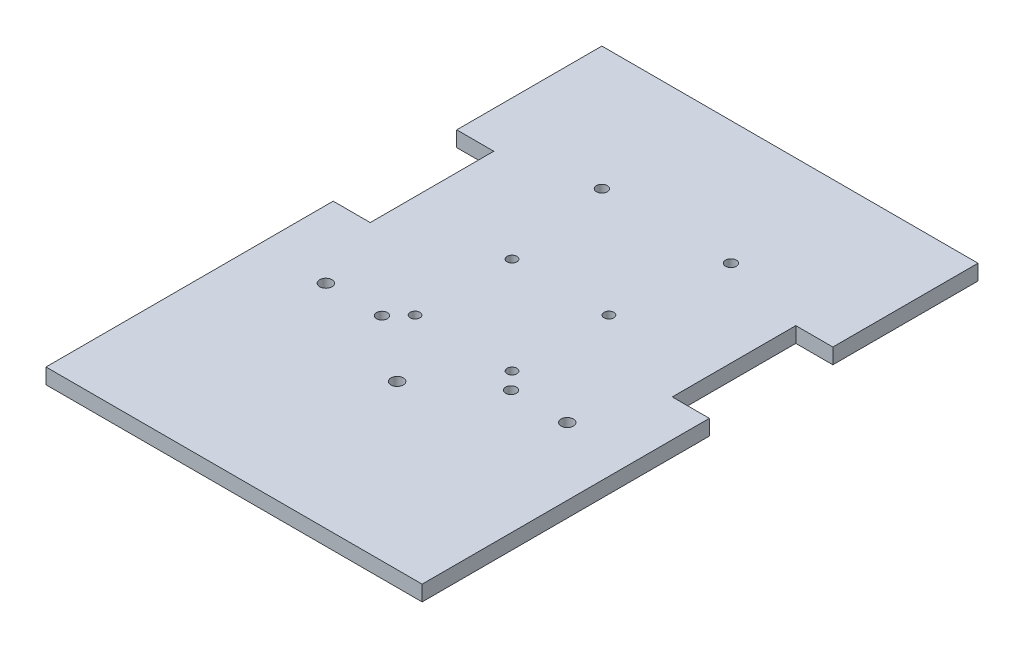
ISO-10303-21;
HEADER;
FILE_DESCRIPTION(('STEP AP214'),'2;1');
FILE_NAME('part.step','',(''),(''),'','','');
FILE_SCHEMA(('AUTOMOTIVE_DESIGN { 1 0 10303 214 1 1 1 1 }'));
ENDSEC;
DATA;
#1=APPLICATION_CONTEXT('core data for automotive mechanical design processes');
#2=APPLICATION_PROTOCOL_DEFINITION('international standard','automotive_design',2000,#1);
#3=PRODUCT_CONTEXT('',#1,'mechanical');
#4=PRODUCT('Part','Part','',(#3));
#5=PRODUCT_RELATED_PRODUCT_CATEGORY('part','',(#4));
#6=PRODUCT_DEFINITION_FORMATION('','',#4);
#7=PRODUCT_DEFINITION_CONTEXT('part definition',#1,'design');
#8=PRODUCT_DEFINITION('design','',#6,#7);
#9=PRODUCT_DEFINITION_SHAPE('','',#8);
#10=(LENGTH_UNIT() NAMED_UNIT(*) SI_UNIT(.MILLI.,.METRE.));
#11=(NAMED_UNIT(*) PLANE_ANGLE_UNIT() SI_UNIT($,.RADIAN.));
#12=(NAMED_UNIT(*) SI_UNIT($,.STERADIAN.) SOLID_ANGLE_UNIT());
#13=UNCERTAINTY_MEASURE_WITH_UNIT(LENGTH_MEASURE(1.E-05),#10,'distance_accuracy_value','');
#14=(GEOMETRIC_REPRESENTATION_CONTEXT(3) GLOBAL_UNCERTAINTY_ASSIGNED_CONTEXT((#13)) GLOBAL_UNIT_ASSIGNED_CONTEXT((#10,
#11,#12)) REPRESENTATION_CONTEXT('',''));
#15=CARTESIAN_POINT('',(0.,0.,0.));
#16=DIRECTION('',(0.,0.,1.));
#17=DIRECTION('',(1.,0.,0.));
#18=AXIS2_PLACEMENT_3D('',#15,#16,#17);
#19=CARTESIAN_POINT('',(-50.8,6.35,-141.244051327118));
#20=DIRECTION('',(1.,0.,0.));
#21=DIRECTION('',(0.,0.,-1.));
#22=AXIS2_PLACEMENT_3D('',#19,#20,#21);
#23=PLANE('',#22);
#24=DIRECTION('',(0.,0.,1.));
#25=VECTOR('',#24,1.);
#26=CARTESIAN_POINT('',(-50.8,0.,-141.244051327118));
#27=LINE('',#26,#25);
#28=CARTESIAN_POINT('',(-50.8,0.,-141.244051327118));
#29=VERTEX_POINT('',#28);
#30=CARTESIAN_POINT('',(-50.8,0.,-81.5540513271177));
#31=VERTEX_POINT('',#30);
#32=EDGE_CURVE('E163',#29,#31,#27,.T.);
#33=ORIENTED_EDGE('',*,*,#32,.T.);
#34=DIRECTION('',(0.,1.,0.));
#35=VECTOR('',#34,1.);
#36=CARTESIAN_POINT('',(-50.8,0.,-81.5540513271177));
#37=LINE('',#36,#35);
#38=CARTESIAN_POINT('',(-50.8,6.35,-81.5540513271177));
#39=VERTEX_POINT('',#38);
#40=EDGE_CURVE('E213',#31,#39,#37,.T.);
#41=ORIENTED_EDGE('',*,*,#40,.T.);
#42=DIRECTION('',(0.,0.,1.));
#43=VECTOR('',#42,1.);
#44=CARTESIAN_POINT('',(-50.8,6.35,-141.244051327118));
#45=LINE('',#44,#43);
#46=CARTESIAN_POINT('',(-50.8,6.35,-141.244051327118));
#47=VERTEX_POINT('',#46);
#48=EDGE_CURVE('E261',#47,#39,#45,.T.);
#49=ORIENTED_EDGE('',*,*,#48,.F.);
#50=DIRECTION('',(0.,-1.,0.));
#51=VECTOR('',#50,1.);
#52=CARTESIAN_POINT('',(-50.8,6.35,-141.244051327118));
#53=LINE('',#52,#51);
#54=EDGE_CURVE('E170',#47,#29,#53,.T.);
#55=ORIENTED_EDGE('',*,*,#54,.T.);
#56=EDGE_LOOP('',(#33,#41,#49,#55));
#57=FACE_BOUND('',#56,.T.);
#58=ADVANCED_FACE('F39',(#57),#23,.F.);
#59=CARTESIAN_POINT('',(103.886,6.35,-141.244051327118));
#60=DIRECTION('',(-1.,0.,0.));
#61=DIRECTION('',(0.,0.,1.));
#62=AXIS2_PLACEMENT_3D('',#59,#60,#61);
#63=PLANE('',#62);
#64=DIRECTION('',(0.,0.,-1.));
#65=VECTOR('',#64,1.);
#66=CARTESIAN_POINT('',(103.886,0.,-141.244051327118));
#67=LINE('',#66,#65);
#68=CARTESIAN_POINT('',(103.886,0.,87.3559486728823));
#69=VERTEX_POINT('',#68);
#70=CARTESIAN_POINT('',(103.886,0.,-30.7540513271177));
#71=VERTEX_POINT('',#70);
#72=EDGE_CURVE('E157',#69,#71,#67,.T.);
#73=ORIENTED_EDGE('',*,*,#72,.T.);
#74=DIRECTION('',(0.,1.,0.));
#75=VECTOR('',#74,1.);
#76=CARTESIAN_POINT('',(103.886,0.,-30.7540513271177));
#77=LINE('',#76,#75);
#78=CARTESIAN_POINT('',(103.886,6.35,-30.7540513271177));
#79=VERTEX_POINT('',#78);
#80=EDGE_CURVE('E236',#71,#79,#77,.T.);
#81=ORIENTED_EDGE('',*,*,#80,.T.);
#82=DIRECTION('',(0.,0.,-1.));
#83=VECTOR('',#82,1.);
#84=CARTESIAN_POINT('',(103.886,6.35,-141.244051327118));
#85=LINE('',#84,#83);
#86=CARTESIAN_POINT('',(103.886,6.35,87.3559486728823));
#87=VERTEX_POINT('',#86);
#88=EDGE_CURVE('E268',#87,#79,#85,.T.);
#89=ORIENTED_EDGE('',*,*,#88,.F.);
#90=DIRECTION('',(0.,-1.,0.));
#91=VECTOR('',#90,1.);
#92=CARTESIAN_POINT('',(103.886,6.35,87.3559486728823));
#93=LINE('',#92,#91);
#94=EDGE_CURVE('E49',#87,#69,#93,.T.);
#95=ORIENTED_EDGE('',*,*,#94,.T.);
#96=EDGE_LOOP('',(#73,#81,#89,#95));
#97=FACE_BOUND('',#96,.T.);
#98=ADVANCED_FACE('F433',(#97),#63,.F.);
#99=CARTESIAN_POINT('',(-50.8,6.35,-30.7540513271177));
#100=VERTEX_POINT('',#99);
#101=CARTESIAN_POINT('',(-50.8,6.35,87.3559486728823));
#102=VERTEX_POINT('',#101);
#103=EDGE_CURVE('E169',#100,#102,#45,.T.);
#104=ORIENTED_EDGE('',*,*,#103,.F.);
#105=DIRECTION('',(0.,1.,0.));
#106=VECTOR('',#105,1.);
#107=CARTESIAN_POINT('',(-50.8,0.,-30.7540513271177));
#108=LINE('',#107,#106);
#109=CARTESIAN_POINT('',(-50.8,0.,-30.7540513271177));
#110=VERTEX_POINT('',#109);
#111=EDGE_CURVE('E224',#110,#100,#108,.T.);
#112=ORIENTED_EDGE('',*,*,#111,.F.);
#113=CARTESIAN_POINT('',(-50.8,0.,87.3559486728823));
#114=VERTEX_POINT('',#113);
#115=EDGE_CURVE('E257',#110,#114,#27,.T.);
#116=ORIENTED_EDGE('',*,*,#115,.T.);
#117=DIRECTION('',(0.,-1.,0.));
#118=VECTOR('',#117,1.);
#119=CARTESIAN_POINT('',(-50.8,6.35,87.3559486728823));
#120=LINE('',#119,#118);
#121=EDGE_CURVE('E11',#102,#114,#120,.T.);
#122=ORIENTED_EDGE('',*,*,#121,.F.);
#123=EDGE_LOOP('',(#104,#112,#116,#122));
#124=FACE_BOUND('',#123,.T.);
#125=ADVANCED_FACE('F41',(#124),#23,.F.);
#126=CARTESIAN_POINT('',(-50.8,6.35,87.3559486728823));
#127=DIRECTION('',(0.,0.,-1.));
#128=DIRECTION('',(-1.,0.,0.));
#129=AXIS2_PLACEMENT_3D('',#126,#127,#128);
#130=PLANE('',#129);
#131=DIRECTION('',(1.,0.,0.));
#132=VECTOR('',#131,1.);
#133=CARTESIAN_POINT('',(-50.8,0.,87.3559486728823));
#134=LINE('',#133,#132);
#135=EDGE_CURVE('E158',#114,#69,#134,.T.);
#136=ORIENTED_EDGE('',*,*,#135,.T.);
#137=ORIENTED_EDGE('',*,*,#94,.F.);
#138=DIRECTION('',(1.,0.,0.));
#139=VECTOR('',#138,1.);
#140=CARTESIAN_POINT('',(-50.8,6.35,87.3559486728823));
#141=LINE('',#140,#139);
#142=EDGE_CURVE('E265',#102,#87,#141,.T.);
#143=ORIENTED_EDGE('',*,*,#142,.F.);
#144=ORIENTED_EDGE('',*,*,#121,.T.);
#145=EDGE_LOOP('',(#136,#137,#143,#144));
#146=FACE_BOUND('',#145,.T.);
#147=ADVANCED_FACE('F289',(#146),#130,.F.);
#148=CARTESIAN_POINT('',(103.886,6.35,-81.5540513271177));
#149=VERTEX_POINT('',#148);
#150=CARTESIAN_POINT('',(103.886,6.35,-141.244051327118));
#151=VERTEX_POINT('',#150);
#152=EDGE_CURVE('E148',#149,#151,#85,.T.);
#153=ORIENTED_EDGE('',*,*,#152,.F.);
#154=DIRECTION('',(0.,1.,0.));
#155=VECTOR('',#154,1.);
#156=CARTESIAN_POINT('',(103.886,0.,-81.5540513271177));
#157=LINE('',#156,#155);
#158=CARTESIAN_POINT('',(103.886,0.,-81.5540513271177));
#159=VERTEX_POINT('',#158);
#160=EDGE_CURVE('E134',#159,#149,#157,.T.);
#161=ORIENTED_EDGE('',*,*,#160,.F.);
#162=CARTESIAN_POINT('',(103.886,0.,-141.244051327118));
#163=VERTEX_POINT('',#162);
#164=EDGE_CURVE('E146',#159,#163,#67,.T.);
#165=ORIENTED_EDGE('',*,*,#164,.T.);
#166=DIRECTION('',(0.,-1.,0.));
#167=VECTOR('',#166,1.);
#168=CARTESIAN_POINT('',(103.886,6.35,-141.244051327118));
#169=LINE('',#168,#167);
#170=EDGE_CURVE('E174',#151,#163,#169,.T.);
#171=ORIENTED_EDGE('',*,*,#170,.F.);
#172=EDGE_LOOP('',(#153,#161,#165,#171));
#173=FACE_BOUND('',#172,.T.);
#174=ADVANCED_FACE('F144',(#173),#63,.F.);
#175=CARTESIAN_POINT('',(-50.8,6.35,-141.244051327118));
#176=DIRECTION('',(0.,0.,1.));
#177=DIRECTION('',(1.,0.,0.));
#178=AXIS2_PLACEMENT_3D('',#175,#176,#177);
#179=PLANE('',#178);
#180=DIRECTION('',(-1.,0.,0.));
#181=VECTOR('',#180,1.);
#182=CARTESIAN_POINT('',(-50.8,0.,-141.244051327118));
#183=LINE('',#182,#181);
#184=EDGE_CURVE('E155',#163,#29,#183,.T.);
#185=ORIENTED_EDGE('',*,*,#184,.T.);
#186=ORIENTED_EDGE('',*,*,#54,.F.);
#187=DIRECTION('',(-1.,0.,0.));
#188=VECTOR('',#187,1.);
#189=CARTESIAN_POINT('',(-50.8,6.35,-141.244051327118));
#190=LINE('',#189,#188);
#191=EDGE_CURVE('E175',#151,#47,#190,.T.);
#192=ORIENTED_EDGE('',*,*,#191,.F.);
#193=ORIENTED_EDGE('',*,*,#170,.T.);
#194=EDGE_LOOP('',(#185,#186,#192,#193));
#195=FACE_BOUND('',#194,.T.);
#196=ADVANCED_FACE('F301',(#195),#179,.F.);
#197=CARTESIAN_POINT('',(0.,6.35,0.));
#198=DIRECTION('',(0.,1.,0.));
#199=DIRECTION('',(0.,0.,1.));
#200=AXIS2_PLACEMENT_3D('',#197,#198,#199);
#201=PLANE('',#200);
#202=CARTESIAN_POINT('',(6.60400000000013,6.35,-46.8830513271177));
#203=DIRECTION('',(0.,1.,0.));
#204=DIRECTION('',(0.,0.,1.));
#205=AXIS2_PLACEMENT_3D('',#202,#203,#204);
#206=CIRCLE('',#205,2.);
#207=CARTESIAN_POINT('',(6.60400000000013,6.35,-44.8830513271177));
#208=VERTEX_POINT('',#207);
#209=EDGE_CURVE('E354',#208,#208,#206,.T.);
#210=ORIENTED_EDGE('',*,*,#209,.F.);
#211=EDGE_LOOP('',(#210));
#212=FACE_BOUND('',#211,.T.);
#213=CARTESIAN_POINT('',(46.482,6.35,-46.8830513271177));
#214=DIRECTION('',(0.,1.,0.));
#215=DIRECTION('',(0.,0.,1.));
#216=AXIS2_PLACEMENT_3D('',#213,#214,#215);
#217=CIRCLE('',#216,2.00000000000001);
#218=CARTESIAN_POINT('',(46.482,6.35,-44.8830513271177));
#219=VERTEX_POINT('',#218);
#220=EDGE_CURVE('E362',#219,#219,#217,.T.);
#221=ORIENTED_EDGE('',*,*,#220,.F.);
#222=EDGE_LOOP('',(#221));
#223=FACE_BOUND('',#222,.T.);
#224=CARTESIAN_POINT('',(46.482,6.35,-7.00505132711769));
#225=DIRECTION('',(0.,1.,0.));
#226=DIRECTION('',(0.,0.,1.));
#227=AXIS2_PLACEMENT_3D('',#224,#225,#226);
#228=CIRCLE('',#227,2.00000000000001);
#229=CARTESIAN_POINT('',(46.482,6.35,-5.00505132711768));
#230=VERTEX_POINT('',#229);
#231=EDGE_CURVE('E370',#230,#230,#228,.T.);
#232=ORIENTED_EDGE('',*,*,#231,.F.);
#233=EDGE_LOOP('',(#232));
#234=FACE_BOUND('',#233,.T.);
#235=CARTESIAN_POINT('',(6.60400000000014,6.35,-7.00505132711769));
#236=DIRECTION('',(0.,1.,0.));
#237=DIRECTION('',(0.,0.,1.));
#238=AXIS2_PLACEMENT_3D('',#235,#236,#237);
#239=CIRCLE('',#238,2.);
#240=CARTESIAN_POINT('',(6.60400000000014,6.35,-5.00505132711768));
#241=VERTEX_POINT('',#240);
#242=EDGE_CURVE('E346',#241,#241,#239,.T.);
#243=ORIENTED_EDGE('',*,*,#242,.F.);
#244=EDGE_LOOP('',(#243));
#245=FACE_BOUND('',#244,.T.);
#246=CARTESIAN_POINT('',(26.550112,6.35,20.29968));
#247=DIRECTION('',(0.,1.,0.));
#248=DIRECTION('',(0.,0.,1.));
#249=AXIS2_PLACEMENT_3D('',#246,#247,#248);
#250=CIRCLE('',#249,2.54);
#251=CARTESIAN_POINT('',(26.550112,6.35,22.83968));
#252=VERTEX_POINT('',#251);
#253=EDGE_CURVE('E185',#252,#252,#250,.T.);
#254=ORIENTED_EDGE('',*,*,#253,.F.);
#255=EDGE_LOOP('',(#254));
#256=FACE_BOUND('',#255,.T.);
#257=CARTESIAN_POINT('',(-23.0770828039394,6.35,-0.0203200000000042));
#258=DIRECTION('',(0.,1.,0.));
#259=DIRECTION('',(0.,0.,1.));
#260=AXIS2_PLACEMENT_3D('',#257,#258,#259);
#261=CIRCLE('',#260,2.54);
#262=CARTESIAN_POINT('',(-23.0770828039394,6.35,2.51968));
#263=VERTEX_POINT('',#262);
#264=EDGE_CURVE('E338',#263,#263,#261,.T.);
#265=ORIENTED_EDGE('',*,*,#264,.F.);
#266=EDGE_LOOP('',(#265));
#267=FACE_BOUND('',#266,.T.);
#268=CARTESIAN_POINT('',(76.1773068039394,6.35,-0.0203200000000042));
#269=DIRECTION('',(0.,1.,0.));
#270=DIRECTION('',(0.,0.,1.));
#271=AXIS2_PLACEMENT_3D('',#268,#269,#270);
#272=CIRCLE('',#271,2.54);
#273=CARTESIAN_POINT('',(76.1773068039394,6.35,2.51967999999999));
#274=VERTEX_POINT('',#273);
#275=EDGE_CURVE('E334',#274,#274,#272,.T.);
#276=ORIENTED_EDGE('',*,*,#275,.F.);
#277=EDGE_LOOP('',(#276));
#278=FACE_BOUND('',#277,.T.);
#279=DIRECTION('',(1.,0.,0.));
#280=VECTOR('',#279,1.);
#281=CARTESIAN_POINT('',(103.886,6.35,-30.7540513271177));
#282=LINE('',#281,#280);
#283=CARTESIAN_POINT('',(88.646,6.35,-30.7540513271177));
#284=VERTEX_POINT('',#283);
#285=EDGE_CURVE('E140',#284,#79,#282,.T.);
#286=ORIENTED_EDGE('',*,*,#285,.F.);
#287=DIRECTION('',(0.,0.,1.));
#288=VECTOR('',#287,1.);
#289=CARTESIAN_POINT('',(88.646,6.35,-81.5540513271177));
#290=LINE('',#289,#288);
#291=CARTESIAN_POINT('',(88.646,6.35,-81.5540513271177));
#292=VERTEX_POINT('',#291);
#293=EDGE_CURVE('E324',#292,#284,#290,.T.);
#294=ORIENTED_EDGE('',*,*,#293,.F.);
#295=DIRECTION('',(-1.,0.,0.));
#296=VECTOR('',#295,1.);
#297=CARTESIAN_POINT('',(103.886,6.35,-81.5540513271177));
#298=LINE('',#297,#296);
#299=EDGE_CURVE('E217',#149,#292,#298,.T.);
#300=ORIENTED_EDGE('',*,*,#299,.F.);
#301=ORIENTED_EDGE('',*,*,#152,.T.);
#302=ORIENTED_EDGE('',*,*,#191,.T.);
#303=ORIENTED_EDGE('',*,*,#48,.T.);
#304=DIRECTION('',(-1.,0.,0.));
#305=VECTOR('',#304,1.);
#306=CARTESIAN_POINT('',(-50.8,6.35,-81.5540513271177));
#307=LINE('',#306,#305);
#308=CARTESIAN_POINT('',(-35.56,6.35,-81.5540513271177));
#309=VERTEX_POINT('',#308);
#310=EDGE_CURVE('E204',#309,#39,#307,.T.);
#311=ORIENTED_EDGE('',*,*,#310,.F.);
#312=DIRECTION('',(0.,0.,-1.));
#313=VECTOR('',#312,1.);
#314=CARTESIAN_POINT('',(-35.56,6.35,-81.5540513271177));
#315=LINE('',#314,#313);
#316=CARTESIAN_POINT('',(-35.56,6.35,-30.7540513271177));
#317=VERTEX_POINT('',#316);
#318=EDGE_CURVE('E197',#317,#309,#315,.T.);
#319=ORIENTED_EDGE('',*,*,#318,.F.);
#320=DIRECTION('',(1.,0.,0.));
#321=VECTOR('',#320,1.);
#322=CARTESIAN_POINT('',(-50.8,6.35,-30.7540513271177));
#323=LINE('',#322,#321);
#324=EDGE_CURVE('E192',#100,#317,#323,.T.);
#325=ORIENTED_EDGE('',*,*,#324,.F.);
#326=ORIENTED_EDGE('',*,*,#103,.T.);
#327=ORIENTED_EDGE('',*,*,#142,.T.);
#328=ORIENTED_EDGE('',*,*,#88,.T.);
#329=EDGE_LOOP('',(#286,#294,#300,#301,#302,#303,#311,#319,#325,#326,#327,#328));
#330=FACE_BOUND('',#329,.T.);
#331=CARTESIAN_POINT('',(53.086,6.35,-90.4440513271177));
#332=DIRECTION('',(0.,1.,0.));
#333=DIRECTION('',(0.,0.,1.));
#334=AXIS2_PLACEMENT_3D('',#331,#332,#333);
#335=CIRCLE('',#334,2.2225);
#336=CARTESIAN_POINT('',(53.086,6.35,-88.2215513271177));
#337=VERTEX_POINT('',#336);
#338=EDGE_CURVE('E237',#337,#337,#335,.T.);
#339=ORIENTED_EDGE('',*,*,#338,.F.);
#340=EDGE_LOOP('',(#339));
#341=FACE_BOUND('',#340,.T.);
#342=CARTESIAN_POINT('',(0.,6.35,0.));
#343=DIRECTION('',(0.,1.,0.));
#344=DIRECTION('',(0.,0.,1.));
#345=AXIS2_PLACEMENT_3D('',#342,#343,#344);
#346=CIRCLE('',#345,2.2225);
#347=CARTESIAN_POINT('',(0.,6.35,2.2225));
#348=VERTEX_POINT('',#347);
#349=EDGE_CURVE('E246',#348,#348,#346,.T.);
#350=ORIENTED_EDGE('',*,*,#349,.F.);
#351=EDGE_LOOP('',(#350));
#352=FACE_BOUND('',#351,.T.);
#353=CARTESIAN_POINT('',(53.086,6.35,0.));
#354=DIRECTION('',(0.,1.,0.));
#355=DIRECTION('',(0.,0.,1.));
#356=AXIS2_PLACEMENT_3D('',#353,#354,#355);
#357=CIRCLE('',#356,2.2225);
#358=CARTESIAN_POINT('',(53.086,6.35,2.2225));
#359=VERTEX_POINT('',#358);
#360=EDGE_CURVE('E227',#359,#359,#357,.T.);
#361=ORIENTED_EDGE('',*,*,#360,.F.);
#362=EDGE_LOOP('',(#361));
#363=FACE_BOUND('',#362,.T.);
#364=CARTESIAN_POINT('',(0.,6.35,-90.4440513271177));
#365=DIRECTION('',(0.,1.,0.));
#366=DIRECTION('',(0.,0.,1.));
#367=AXIS2_PLACEMENT_3D('',#364,#365,#366);
#368=CIRCLE('',#367,2.2225);
#369=CARTESIAN_POINT('',(0.,6.35,-88.2215513271177));
#370=VERTEX_POINT('',#369);
#371=EDGE_CURVE('E253',#370,#370,#368,.T.);
#372=ORIENTED_EDGE('',*,*,#371,.F.);
#373=EDGE_LOOP('',(#372));
#374=FACE_BOUND('',#373,.T.);
#375=ADVANCED_FACE('F293',(#212,#223,#234,#245,#256,#267,#278,#330,#341,#352,#363,#374),#201,.T.);
#376=CARTESIAN_POINT('',(0.,0.,0.));
#377=DIRECTION('',(0.,1.,0.));
#378=DIRECTION('',(0.,0.,1.));
#379=AXIS2_PLACEMENT_3D('',#376,#377,#378);
#380=PLANE('',#379);
#381=CARTESIAN_POINT('',(6.60400000000013,0.,-46.8830513271177));
#382=DIRECTION('',(0.,1.,0.));
#383=DIRECTION('',(0.,0.,1.));
#384=AXIS2_PLACEMENT_3D('',#381,#382,#383);
#385=CIRCLE('',#384,2.);
#386=CARTESIAN_POINT('',(6.60400000000013,0.,-44.8830513271177));
#387=VERTEX_POINT('',#386);
#388=EDGE_CURVE('E358',#387,#387,#385,.T.);
#389=ORIENTED_EDGE('',*,*,#388,.T.);
#390=EDGE_LOOP('',(#389));
#391=FACE_BOUND('',#390,.T.);
#392=CARTESIAN_POINT('',(46.482,0.,-46.8830513271177));
#393=DIRECTION('',(0.,1.,0.));
#394=DIRECTION('',(0.,0.,1.));
#395=AXIS2_PLACEMENT_3D('',#392,#393,#394);
#396=CIRCLE('',#395,2.00000000000001);
#397=CARTESIAN_POINT('',(46.482,0.,-44.8830513271177));
#398=VERTEX_POINT('',#397);
#399=EDGE_CURVE('E366',#398,#398,#396,.T.);
#400=ORIENTED_EDGE('',*,*,#399,.T.);
#401=EDGE_LOOP('',(#400));
#402=FACE_BOUND('',#401,.T.);
#403=CARTESIAN_POINT('',(46.482,0.,-7.00505132711769));
#404=DIRECTION('',(0.,1.,0.));
#405=DIRECTION('',(0.,0.,1.));
#406=AXIS2_PLACEMENT_3D('',#403,#404,#405);
#407=CIRCLE('',#406,2.00000000000001);
#408=CARTESIAN_POINT('',(46.482,0.,-5.00505132711768));
#409=VERTEX_POINT('',#408);
#410=EDGE_CURVE('E350',#409,#409,#407,.T.);
#411=ORIENTED_EDGE('',*,*,#410,.T.);
#412=EDGE_LOOP('',(#411));
#413=FACE_BOUND('',#412,.T.);
#414=CARTESIAN_POINT('',(6.60400000000014,0.,-7.00505132711769));
#415=DIRECTION('',(0.,1.,0.));
#416=DIRECTION('',(0.,0.,1.));
#417=AXIS2_PLACEMENT_3D('',#414,#415,#416);
#418=CIRCLE('',#417,2.);
#419=CARTESIAN_POINT('',(6.60400000000014,0.,-5.00505132711768));
#420=VERTEX_POINT('',#419);
#421=EDGE_CURVE('E339',#420,#420,#418,.T.);
#422=ORIENTED_EDGE('',*,*,#421,.T.);
#423=EDGE_LOOP('',(#422));
#424=FACE_BOUND('',#423,.T.);
#425=CARTESIAN_POINT('',(26.550112,0.,20.29968));
#426=DIRECTION('',(0.,1.,0.));
#427=DIRECTION('',(0.,0.,1.));
#428=AXIS2_PLACEMENT_3D('',#425,#426,#427);
#429=CIRCLE('',#428,2.54);
#430=CARTESIAN_POINT('',(26.550112,0.,22.83968));
#431=VERTEX_POINT('',#430);
#432=EDGE_CURVE('E43',#431,#431,#429,.T.);
#433=ORIENTED_EDGE('',*,*,#432,.T.);
#434=EDGE_LOOP('',(#433));
#435=FACE_BOUND('',#434,.T.);
#436=CARTESIAN_POINT('',(-23.0770828039394,0.,-0.0203200000000042));
#437=DIRECTION('',(0.,1.,0.));
#438=DIRECTION('',(0.,0.,1.));
#439=AXIS2_PLACEMENT_3D('',#436,#437,#438);
#440=CIRCLE('',#439,2.54);
#441=CARTESIAN_POINT('',(-23.0770828039394,0.,2.51968));
#442=VERTEX_POINT('',#441);
#443=EDGE_CURVE('E184',#442,#442,#440,.T.);
#444=ORIENTED_EDGE('',*,*,#443,.T.);
#445=EDGE_LOOP('',(#444));
#446=FACE_BOUND('',#445,.T.);
#447=CARTESIAN_POINT('',(76.1773068039394,0.,-0.0203200000000042));
#448=DIRECTION('',(0.,1.,0.));
#449=DIRECTION('',(0.,0.,1.));
#450=AXIS2_PLACEMENT_3D('',#447,#448,#449);
#451=CIRCLE('',#450,2.54);
#452=CARTESIAN_POINT('',(76.1773068039394,0.,2.51967999999999));
#453=VERTEX_POINT('',#452);
#454=EDGE_CURVE('E181',#453,#453,#451,.T.);
#455=ORIENTED_EDGE('',*,*,#454,.T.);
#456=EDGE_LOOP('',(#455));
#457=FACE_BOUND('',#456,.T.);
#458=CARTESIAN_POINT('',(53.086,0.,-90.4440513271177));
#459=DIRECTION('',(0.,1.,0.));
#460=DIRECTION('',(0.,0.,1.));
#461=AXIS2_PLACEMENT_3D('',#458,#459,#460);
#462=CIRCLE('',#461,2.2225);
#463=CARTESIAN_POINT('',(53.086,0.,-88.2215513271177));
#464=VERTEX_POINT('',#463);
#465=EDGE_CURVE('E242',#464,#464,#462,.T.);
#466=ORIENTED_EDGE('',*,*,#465,.T.);
#467=EDGE_LOOP('',(#466));
#468=FACE_BOUND('',#467,.T.);
#469=CARTESIAN_POINT('',(0.,0.,0.));
#470=DIRECTION('',(0.,1.,0.));
#471=DIRECTION('',(0.,0.,1.));
#472=AXIS2_PLACEMENT_3D('',#469,#470,#471);
#473=CIRCLE('',#472,2.2225);
#474=CARTESIAN_POINT('',(0.,0.,2.2225));
#475=VERTEX_POINT('',#474);
#476=EDGE_CURVE('E231',#475,#475,#473,.T.);
#477=ORIENTED_EDGE('',*,*,#476,.T.);
#478=EDGE_LOOP('',(#477));
#479=FACE_BOUND('',#478,.T.);
#480=CARTESIAN_POINT('',(53.086,0.,0.));
#481=DIRECTION('',(0.,1.,0.));
#482=DIRECTION('',(0.,0.,1.));
#483=AXIS2_PLACEMENT_3D('',#480,#481,#482);
#484=CIRCLE('',#483,2.2225);
#485=CARTESIAN_POINT('',(53.086,0.,2.2225));
#486=VERTEX_POINT('',#485);
#487=EDGE_CURVE('E232',#486,#486,#484,.T.);
#488=ORIENTED_EDGE('',*,*,#487,.T.);
#489=EDGE_LOOP('',(#488));
#490=FACE_BOUND('',#489,.T.);
#491=CARTESIAN_POINT('',(0.,0.,-90.4440513271177));
#492=DIRECTION('',(0.,1.,0.));
#493=DIRECTION('',(0.,0.,1.));
#494=AXIS2_PLACEMENT_3D('',#491,#492,#493);
#495=CIRCLE('',#494,2.2225);
#496=CARTESIAN_POINT('',(0.,0.,-88.2215513271177));
#497=VERTEX_POINT('',#496);
#498=EDGE_CURVE('E241',#497,#497,#495,.T.);
#499=ORIENTED_EDGE('',*,*,#498,.T.);
#500=EDGE_LOOP('',(#499));
#501=FACE_BOUND('',#500,.T.);
#502=DIRECTION('',(0.,0.,1.));
#503=VECTOR('',#502,1.);
#504=CARTESIAN_POINT('',(88.646,0.,-81.5540513271177));
#505=LINE('',#504,#503);
#506=CARTESIAN_POINT('',(88.646,0.,-81.5540513271177));
#507=VERTEX_POINT('',#506);
#508=CARTESIAN_POINT('',(88.646,0.,-30.7540513271177));
#509=VERTEX_POINT('',#508);
#510=EDGE_CURVE('E57',#507,#509,#505,.T.);
#511=ORIENTED_EDGE('',*,*,#510,.T.);
#512=DIRECTION('',(1.,0.,0.));
#513=VECTOR('',#512,1.);
#514=CARTESIAN_POINT('',(103.886,0.,-30.7540513271177));
#515=LINE('',#514,#513);
#516=EDGE_CURVE('E150',#509,#71,#515,.T.);
#517=ORIENTED_EDGE('',*,*,#516,.T.);
#518=ORIENTED_EDGE('',*,*,#72,.F.);
#519=ORIENTED_EDGE('',*,*,#135,.F.);
#520=ORIENTED_EDGE('',*,*,#115,.F.);
#521=DIRECTION('',(1.,0.,0.));
#522=VECTOR('',#521,1.);
#523=CARTESIAN_POINT('',(-50.8,0.,-30.7540513271177));
#524=LINE('',#523,#522);
#525=CARTESIAN_POINT('',(-35.56,0.,-30.7540513271177));
#526=VERTEX_POINT('',#525);
#527=EDGE_CURVE('E212',#110,#526,#524,.T.);
#528=ORIENTED_EDGE('',*,*,#527,.T.);
#529=DIRECTION('',(0.,0.,-1.));
#530=VECTOR('',#529,1.);
#531=CARTESIAN_POINT('',(-35.56,0.,-81.5540513271177));
#532=LINE('',#531,#530);
#533=CARTESIAN_POINT('',(-35.56,0.,-81.5540513271177));
#534=VERTEX_POINT('',#533);
#535=EDGE_CURVE('E65',#526,#534,#532,.T.);
#536=ORIENTED_EDGE('',*,*,#535,.T.);
#537=DIRECTION('',(-1.,0.,0.));
#538=VECTOR('',#537,1.);
#539=CARTESIAN_POINT('',(-50.8,0.,-81.5540513271177));
#540=LINE('',#539,#538);
#541=EDGE_CURVE('E207',#534,#31,#540,.T.);
#542=ORIENTED_EDGE('',*,*,#541,.T.);
#543=ORIENTED_EDGE('',*,*,#32,.F.);
#544=ORIENTED_EDGE('',*,*,#184,.F.);
#545=ORIENTED_EDGE('',*,*,#164,.F.);
#546=DIRECTION('',(-1.,0.,0.));
#547=VECTOR('',#546,1.);
#548=CARTESIAN_POINT('',(103.886,0.,-81.5540513271177));
#549=LINE('',#548,#547);
#550=EDGE_CURVE('E130',#159,#507,#549,.T.);
#551=ORIENTED_EDGE('',*,*,#550,.T.);
#552=EDGE_LOOP('',(#511,#517,#518,#519,#520,#528,#536,#542,#543,#544,#545,#551));
#553=FACE_BOUND('',#552,.T.);
#554=ADVANCED_FACE('F153',(#391,#402,#413,#424,#435,#446,#457,#468,#479,#490,#501,#553),#380,.F.);
#555=CARTESIAN_POINT('',(0.,6.35,-90.4440513271177));
#556=DIRECTION('',(0.,-1.,0.));
#557=DIRECTION('',(0.,0.,-1.));
#558=AXIS2_PLACEMENT_3D('',#555,#556,#557);
#559=CYLINDRICAL_SURFACE('',#558,2.2225);
#560=ORIENTED_EDGE('',*,*,#371,.T.);
#561=EDGE_LOOP('',(#560));
#562=FACE_BOUND('',#561,.T.);
#563=ORIENTED_EDGE('',*,*,#498,.F.);
#564=EDGE_LOOP('',(#563));
#565=FACE_BOUND('',#564,.T.);
#566=ADVANCED_FACE('F409',(#562,#565),#559,.F.);
#567=CARTESIAN_POINT('',(53.086,6.35,0.));
#568=DIRECTION('',(0.,-1.,0.));
#569=DIRECTION('',(0.,0.,-1.));
#570=AXIS2_PLACEMENT_3D('',#567,#568,#569);
#571=CYLINDRICAL_SURFACE('',#570,2.2225);
#572=ORIENTED_EDGE('',*,*,#360,.T.);
#573=EDGE_LOOP('',(#572));
#574=FACE_BOUND('',#573,.T.);
#575=ORIENTED_EDGE('',*,*,#487,.F.);
#576=EDGE_LOOP('',(#575));
#577=FACE_BOUND('',#576,.T.);
#578=ADVANCED_FACE('F421',(#574,#577),#571,.F.);
#579=CARTESIAN_POINT('',(0.,6.35,0.));
#580=DIRECTION('',(0.,-1.,0.));
#581=DIRECTION('',(0.,0.,-1.));
#582=AXIS2_PLACEMENT_3D('',#579,#580,#581);
#583=CYLINDRICAL_SURFACE('',#582,2.2225);
#584=ORIENTED_EDGE('',*,*,#349,.T.);
#585=EDGE_LOOP('',(#584));
#586=FACE_BOUND('',#585,.T.);
#587=ORIENTED_EDGE('',*,*,#476,.F.);
#588=EDGE_LOOP('',(#587));
#589=FACE_BOUND('',#588,.T.);
#590=ADVANCED_FACE('F428',(#586,#589),#583,.F.);
#591=CARTESIAN_POINT('',(53.086,6.35,-90.4440513271177));
#592=DIRECTION('',(0.,-1.,0.));
#593=DIRECTION('',(0.,0.,-1.));
#594=AXIS2_PLACEMENT_3D('',#591,#592,#593);
#595=CYLINDRICAL_SURFACE('',#594,2.2225);
#596=ORIENTED_EDGE('',*,*,#338,.T.);
#597=EDGE_LOOP('',(#596));
#598=FACE_BOUND('',#597,.T.);
#599=ORIENTED_EDGE('',*,*,#465,.F.);
#600=EDGE_LOOP('',(#599));
#601=FACE_BOUND('',#600,.T.);
#602=ADVANCED_FACE('F523',(#598,#601),#595,.F.);
#603=CARTESIAN_POINT('',(-50.8,0.,-81.5540513271177));
#604=DIRECTION('',(0.,0.,-1.));
#605=DIRECTION('',(-1.,0.,0.));
#606=AXIS2_PLACEMENT_3D('',#603,#604,#605);
#607=PLANE('',#606);
#608=ORIENTED_EDGE('',*,*,#310,.T.);
#609=ORIENTED_EDGE('',*,*,#40,.F.);
#610=ORIENTED_EDGE('',*,*,#541,.F.);
#611=DIRECTION('',(0.,1.,0.));
#612=VECTOR('',#611,1.);
#613=CARTESIAN_POINT('',(-35.56,0.,-81.5540513271177));
#614=LINE('',#613,#612);
#615=EDGE_CURVE('E218',#534,#309,#614,.T.);
#616=ORIENTED_EDGE('',*,*,#615,.T.);
#617=EDGE_LOOP('',(#608,#609,#610,#616));
#618=FACE_BOUND('',#617,.T.);
#619=ADVANCED_FACE('F305',(#618),#607,.F.);
#620=CARTESIAN_POINT('',(-35.56,0.,-81.5540513271177));
#621=DIRECTION('',(1.,0.,0.));
#622=DIRECTION('',(0.,0.,-1.));
#623=AXIS2_PLACEMENT_3D('',#620,#621,#622);
#624=PLANE('',#623);
#625=ORIENTED_EDGE('',*,*,#318,.T.);
#626=ORIENTED_EDGE('',*,*,#615,.F.);
#627=ORIENTED_EDGE('',*,*,#535,.F.);
#628=DIRECTION('',(0.,1.,0.));
#629=VECTOR('',#628,1.);
#630=CARTESIAN_POINT('',(-35.56,0.,-30.7540513271177));
#631=LINE('',#630,#629);
#632=EDGE_CURVE('E221',#526,#317,#631,.T.);
#633=ORIENTED_EDGE('',*,*,#632,.T.);
#634=EDGE_LOOP('',(#625,#626,#627,#633));
#635=FACE_BOUND('',#634,.T.);
#636=ADVANCED_FACE('F308',(#635),#624,.F.);
#637=CARTESIAN_POINT('',(-50.8,0.,-30.7540513271177));
#638=DIRECTION('',(0.,0.,1.));
#639=DIRECTION('',(1.,0.,0.));
#640=AXIS2_PLACEMENT_3D('',#637,#638,#639);
#641=PLANE('',#640);
#642=ORIENTED_EDGE('',*,*,#324,.T.);
#643=ORIENTED_EDGE('',*,*,#632,.F.);
#644=ORIENTED_EDGE('',*,*,#527,.F.);
#645=ORIENTED_EDGE('',*,*,#111,.T.);
#646=EDGE_LOOP('',(#642,#643,#644,#645));
#647=FACE_BOUND('',#646,.T.);
#648=ADVANCED_FACE('F309',(#647),#641,.F.);
#649=CARTESIAN_POINT('',(103.886,0.,-30.7540513271177));
#650=DIRECTION('',(0.,0.,1.));
#651=DIRECTION('',(1.,0.,0.));
#652=AXIS2_PLACEMENT_3D('',#649,#650,#651);
#653=PLANE('',#652);
#654=ORIENTED_EDGE('',*,*,#285,.T.);
#655=ORIENTED_EDGE('',*,*,#80,.F.);
#656=ORIENTED_EDGE('',*,*,#516,.F.);
#657=DIRECTION('',(0.,1.,0.));
#658=VECTOR('',#657,1.);
#659=CARTESIAN_POINT('',(88.646,0.,-30.7540513271177));
#660=LINE('',#659,#658);
#661=EDGE_CURVE('E316',#509,#284,#660,.T.);
#662=ORIENTED_EDGE('',*,*,#661,.T.);
#663=EDGE_LOOP('',(#654,#655,#656,#662));
#664=FACE_BOUND('',#663,.T.);
#665=ADVANCED_FACE('F512',(#664),#653,.F.);
#666=CARTESIAN_POINT('',(88.646,0.,-81.5540513271177));
#667=DIRECTION('',(-1.,0.,0.));
#668=DIRECTION('',(0.,0.,1.));
#669=AXIS2_PLACEMENT_3D('',#666,#667,#668);
#670=PLANE('',#669);
#671=ORIENTED_EDGE('',*,*,#293,.T.);
#672=ORIENTED_EDGE('',*,*,#661,.F.);
#673=ORIENTED_EDGE('',*,*,#510,.F.);
#674=DIRECTION('',(0.,1.,0.));
#675=VECTOR('',#674,1.);
#676=CARTESIAN_POINT('',(88.646,0.,-81.5540513271177));
#677=LINE('',#676,#675);
#678=EDGE_CURVE('E136',#507,#292,#677,.T.);
#679=ORIENTED_EDGE('',*,*,#678,.T.);
#680=EDGE_LOOP('',(#671,#672,#673,#679));
#681=FACE_BOUND('',#680,.T.);
#682=ADVANCED_FACE('F515',(#681),#670,.F.);
#683=CARTESIAN_POINT('',(103.886,0.,-81.5540513271177));
#684=DIRECTION('',(0.,0.,-1.));
#685=DIRECTION('',(-1.,0.,0.));
#686=AXIS2_PLACEMENT_3D('',#683,#684,#685);
#687=PLANE('',#686);
#688=ORIENTED_EDGE('',*,*,#299,.T.);
#689=ORIENTED_EDGE('',*,*,#678,.F.);
#690=ORIENTED_EDGE('',*,*,#550,.F.);
#691=ORIENTED_EDGE('',*,*,#160,.T.);
#692=EDGE_LOOP('',(#688,#689,#690,#691));
#693=FACE_BOUND('',#692,.T.);
#694=ADVANCED_FACE('F133',(#693),#687,.F.);
#695=CARTESIAN_POINT('',(76.1773068039394,-11.43,-0.0203200000000042));
#696=DIRECTION('',(0.,1.,0.));
#697=DIRECTION('',(0.,0.,1.));
#698=AXIS2_PLACEMENT_3D('',#695,#696,#697);
#699=CYLINDRICAL_SURFACE('',#698,2.54);
#700=ORIENTED_EDGE('',*,*,#275,.T.);
#701=EDGE_LOOP('',(#700));
#702=FACE_BOUND('',#701,.T.);
#703=ORIENTED_EDGE('',*,*,#454,.F.);
#704=EDGE_LOOP('',(#703));
#705=FACE_BOUND('',#704,.T.);
#706=ADVANCED_FACE('F400',(#702,#705),#699,.F.);
#707=CARTESIAN_POINT('',(-23.0770828039394,-11.43,-0.0203200000000042));
#708=DIRECTION('',(0.,1.,0.));
#709=DIRECTION('',(0.,0.,1.));
#710=AXIS2_PLACEMENT_3D('',#707,#708,#709);
#711=CYLINDRICAL_SURFACE('',#710,2.54);
#712=ORIENTED_EDGE('',*,*,#264,.T.);
#713=EDGE_LOOP('',(#712));
#714=FACE_BOUND('',#713,.T.);
#715=ORIENTED_EDGE('',*,*,#443,.F.);
#716=EDGE_LOOP('',(#715));
#717=FACE_BOUND('',#716,.T.);
#718=ADVANCED_FACE('F403',(#714,#717),#711,.F.);
#719=CARTESIAN_POINT('',(26.550112,-11.43,20.29968));
#720=DIRECTION('',(0.,1.,0.));
#721=DIRECTION('',(0.,0.,1.));
#722=AXIS2_PLACEMENT_3D('',#719,#720,#721);
#723=CYLINDRICAL_SURFACE('',#722,2.54);
#724=ORIENTED_EDGE('',*,*,#253,.T.);
#725=EDGE_LOOP('',(#724));
#726=FACE_BOUND('',#725,.T.);
#727=ORIENTED_EDGE('',*,*,#432,.F.);
#728=EDGE_LOOP('',(#727));
#729=FACE_BOUND('',#728,.T.);
#730=ADVANCED_FACE('F472',(#726,#729),#723,.F.);
#731=CARTESIAN_POINT('',(6.60400000000014,0.,-7.00505132711769));
#732=DIRECTION('',(0.,1.,0.));
#733=DIRECTION('',(0.,0.,1.));
#734=AXIS2_PLACEMENT_3D('',#731,#732,#733);
#735=CYLINDRICAL_SURFACE('',#734,2.);
#736=ORIENTED_EDGE('',*,*,#421,.F.);
#737=EDGE_LOOP('',(#736));
#738=FACE_BOUND('',#737,.T.);
#739=ORIENTED_EDGE('',*,*,#242,.T.);
#740=EDGE_LOOP('',(#739));
#741=FACE_BOUND('',#740,.T.);
#742=ADVANCED_FACE('F384',(#738,#741),#735,.F.);
#743=CARTESIAN_POINT('',(46.482,0.,-7.00505132711769));
#744=DIRECTION('',(0.,1.,0.));
#745=DIRECTION('',(0.,0.,1.));
#746=AXIS2_PLACEMENT_3D('',#743,#744,#745);
#747=CYLINDRICAL_SURFACE('',#746,2.00000000000001);
#748=ORIENTED_EDGE('',*,*,#410,.F.);
#749=EDGE_LOOP('',(#748));
#750=FACE_BOUND('',#749,.T.);
#751=ORIENTED_EDGE('',*,*,#231,.T.);
#752=EDGE_LOOP('',(#751));
#753=FACE_BOUND('',#752,.T.);
#754=ADVANCED_FACE('F380',(#750,#753),#747,.F.);
#755=CARTESIAN_POINT('',(46.482,0.,-46.8830513271177));
#756=DIRECTION('',(0.,1.,0.));
#757=DIRECTION('',(0.,0.,1.));
#758=AXIS2_PLACEMENT_3D('',#755,#756,#757);
#759=CYLINDRICAL_SURFACE('',#758,2.00000000000001);
#760=ORIENTED_EDGE('',*,*,#399,.F.);
#761=EDGE_LOOP('',(#760));
#762=FACE_BOUND('',#761,.T.);
#763=ORIENTED_EDGE('',*,*,#220,.T.);
#764=EDGE_LOOP('',(#763));
#765=FACE_BOUND('',#764,.T.);
#766=ADVANCED_FACE('F383',(#762,#765),#759,.F.);
#767=CARTESIAN_POINT('',(6.60400000000013,0.,-46.8830513271177));
#768=DIRECTION('',(0.,1.,0.));
#769=DIRECTION('',(0.,0.,1.));
#770=AXIS2_PLACEMENT_3D('',#767,#768,#769);
#771=CYLINDRICAL_SURFACE('',#770,2.);
#772=ORIENTED_EDGE('',*,*,#388,.F.);
#773=EDGE_LOOP('',(#772));
#774=FACE_BOUND('',#773,.T.);
#775=ORIENTED_EDGE('',*,*,#209,.T.);
#776=EDGE_LOOP('',(#775));
#777=FACE_BOUND('',#776,.T.);
#778=ADVANCED_FACE('F490',(#774,#777),#771,.F.);
#779=CLOSED_SHELL('',(#58,#98,#125,#147,#174,#196,#375,#554,#566,#578,#590,#602,#619,#636,#648,
#665,#682,#694,#706,#718,#730,#742,#754,#766,#778));
#780=MANIFOLD_SOLID_BREP('B2',#779);
#781=ADVANCED_BREP_SHAPE_REPRESENTATION('',(#18,#780),#14);
#782=SHAPE_DEFINITION_REPRESENTATION(#9,#781);
ENDSEC;
END-ISO-10303-21;
